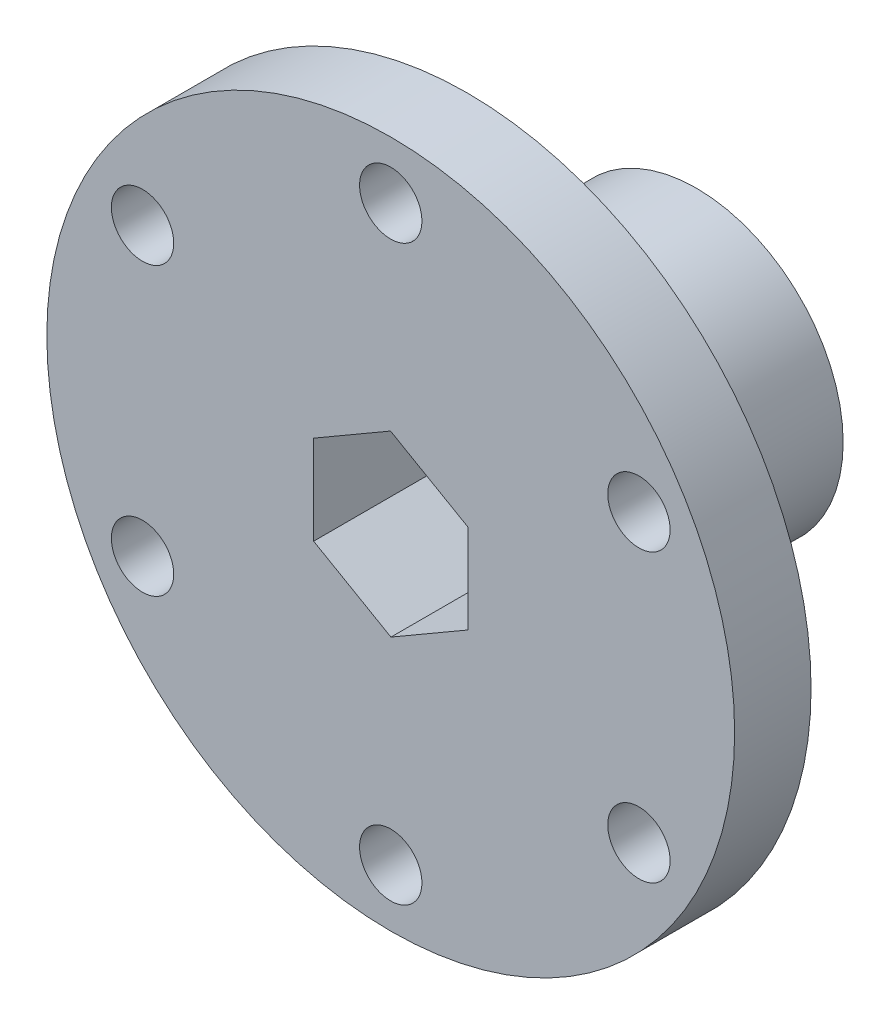
ISO-10303-21;
HEADER;
FILE_DESCRIPTION(('STEP AP214'),'2;1');
FILE_NAME('part.step','',(''),(''),'','','');
FILE_SCHEMA(('AUTOMOTIVE_DESIGN { 1 0 10303 214 1 1 1 1 }'));
ENDSEC;
DATA;
#1=APPLICATION_CONTEXT('core data for automotive mechanical design processes');
#2=APPLICATION_PROTOCOL_DEFINITION('international standard','automotive_design',2000,#1);
#3=PRODUCT_CONTEXT('',#1,'mechanical');
#4=PRODUCT('Part','Part','',(#3));
#5=PRODUCT_RELATED_PRODUCT_CATEGORY('part','',(#4));
#6=PRODUCT_DEFINITION_FORMATION('','',#4);
#7=PRODUCT_DEFINITION_CONTEXT('part definition',#1,'design');
#8=PRODUCT_DEFINITION('design','',#6,#7);
#9=PRODUCT_DEFINITION_SHAPE('','',#8);
#10=(LENGTH_UNIT() NAMED_UNIT(*) SI_UNIT(.MILLI.,.METRE.));
#11=(NAMED_UNIT(*) PLANE_ANGLE_UNIT() SI_UNIT($,.RADIAN.));
#12=(NAMED_UNIT(*) SI_UNIT($,.STERADIAN.) SOLID_ANGLE_UNIT());
#13=UNCERTAINTY_MEASURE_WITH_UNIT(LENGTH_MEASURE(1.E-05),#10,'distance_accuracy_value','');
#14=(GEOMETRIC_REPRESENTATION_CONTEXT(3) GLOBAL_UNCERTAINTY_ASSIGNED_CONTEXT((#13)) GLOBAL_UNIT_ASSIGNED_CONTEXT((#10,
#11,#12)) REPRESENTATION_CONTEXT('',''));
#15=CARTESIAN_POINT('',(0.,0.,0.));
#16=DIRECTION('',(0.,0.,1.));
#17=DIRECTION('',(1.,0.,0.));
#18=AXIS2_PLACEMENT_3D('',#15,#16,#17);
#19=CARTESIAN_POINT('',(0.,0.,6.35));
#20=DIRECTION('',(0.,0.,1.));
#21=DIRECTION('',(1.,0.,0.));
#22=AXIS2_PLACEMENT_3D('',#19,#20,#21);
#23=PLANE('',#22);
#24=DIRECTION('',(0.864943139167897,0.501869869594086,0.));
#25=VECTOR('',#24,1.);
#26=CARTESIAN_POINT('',(0.0159998569727818,-7.4056546191347,6.35));
#27=LINE('',#26,#25);
#28=CARTESIAN_POINT('',(0.0159998569727818,-7.4056546191347,6.35));
#29=VERTEX_POINT('',#28);
#30=CARTESIAN_POINT('',(6.42148496031061,-3.688971026972,6.35));
#31=VERTEX_POINT('',#30);
#32=EDGE_CURVE('E57',#29,#31,#27,.T.);
#33=ORIENTED_EDGE('',*,*,#32,.F.);
#34=DIRECTION('',(0.86710362604641,-0.498127796551414,0.));
#35=VECTOR('',#34,1.);
#36=CARTESIAN_POINT('',(-6.40548510333783,-3.7166835921627,6.35));
#37=LINE('',#36,#35);
#38=CARTESIAN_POINT('',(-6.40548510333783,-3.7166835921627,6.35));
#39=VERTEX_POINT('',#38);
#40=EDGE_CURVE('E125',#39,#29,#37,.T.);
#41=ORIENTED_EDGE('',*,*,#40,.F.);
#42=DIRECTION('',(0.00216048687851377,-0.999997666145501,0.));
#43=VECTOR('',#42,1.);
#44=CARTESIAN_POINT('',(-6.42148496031061,3.688971026972,6.35));
#45=LINE('',#44,#43);
#46=CARTESIAN_POINT('',(-6.42148496031061,3.688971026972,6.35));
#47=VERTEX_POINT('',#46);
#48=EDGE_CURVE('E131',#47,#39,#45,.T.);
#49=ORIENTED_EDGE('',*,*,#48,.F.);
#50=DIRECTION('',(-0.864943139167896,-0.501869869594086,0.));
#51=VECTOR('',#50,1.);
#52=CARTESIAN_POINT('',(-0.0159998569727818,7.4056546191347,6.35));
#53=LINE('',#52,#51);
#54=CARTESIAN_POINT('',(-0.0159998569727818,7.4056546191347,6.35));
#55=VERTEX_POINT('',#54);
#56=EDGE_CURVE('E153',#55,#47,#53,.T.);
#57=ORIENTED_EDGE('',*,*,#56,.F.);
#58=DIRECTION('',(-0.86710362604641,0.498127796551414,0.));
#59=VECTOR('',#58,1.);
#60=CARTESIAN_POINT('',(6.40548510333783,3.7166835921627,6.35));
#61=LINE('',#60,#59);
#62=CARTESIAN_POINT('',(6.40548510333783,3.7166835921627,6.35));
#63=VERTEX_POINT('',#62);
#64=EDGE_CURVE('E150',#63,#55,#61,.T.);
#65=ORIENTED_EDGE('',*,*,#64,.F.);
#66=DIRECTION('',(-0.00216048687851365,0.9999976661455,0.));
#67=VECTOR('',#66,1.);
#68=CARTESIAN_POINT('',(6.42148496031061,-3.688971026972,6.35));
#69=LINE('',#68,#67);
#70=EDGE_CURVE('E147',#31,#63,#69,.T.);
#71=ORIENTED_EDGE('',*,*,#70,.F.);
#72=EDGE_LOOP('',(#33,#41,#49,#57,#65,#71));
#73=FACE_BOUND('',#72,.T.);
#74=CARTESIAN_POINT('',(-20.6222299276159,-11.9062500000006,6.35));
#75=DIRECTION('',(0.,0.,1.));
#76=DIRECTION('',(1.,0.,0.));
#77=AXIS2_PLACEMENT_3D('',#74,#75,#76);
#78=CIRCLE('',#77,2.59080000000136);
#79=CARTESIAN_POINT('',(-18.0314299276146,-11.9062500000006,6.35));
#80=VERTEX_POINT('',#79);
#81=EDGE_CURVE('E185',#80,#80,#78,.T.);
#82=ORIENTED_EDGE('',*,*,#81,.F.);
#83=EDGE_LOOP('',(#82));
#84=FACE_BOUND('',#83,.T.);
#85=CARTESIAN_POINT('',(20.622229927618,-11.9062499999994,6.35));
#86=DIRECTION('',(0.,0.,1.));
#87=DIRECTION('',(1.,0.,0.));
#88=AXIS2_PLACEMENT_3D('',#85,#86,#87);
#89=CIRCLE('',#88,2.59080000000091);
#90=CARTESIAN_POINT('',(23.2130299276189,-11.9062499999994,6.35));
#91=VERTEX_POINT('',#90);
#92=EDGE_CURVE('E201',#91,#91,#89,.T.);
#93=ORIENTED_EDGE('',*,*,#92,.F.);
#94=EDGE_LOOP('',(#93));
#95=FACE_BOUND('',#94,.T.);
#96=CARTESIAN_POINT('',(0.,23.8125,6.35));
#97=DIRECTION('',(0.,0.,1.));
#98=DIRECTION('',(1.,0.,0.));
#99=AXIS2_PLACEMENT_3D('',#96,#97,#98);
#100=CIRCLE('',#99,2.5908);
#101=CARTESIAN_POINT('',(2.5908,23.8125,6.35));
#102=VERTEX_POINT('',#101);
#103=EDGE_CURVE('E213',#102,#102,#100,.T.);
#104=ORIENTED_EDGE('',*,*,#103,.F.);
#105=EDGE_LOOP('',(#104));
#106=FACE_BOUND('',#105,.T.);
#107=CARTESIAN_POINT('',(0.,0.,6.35));
#108=DIRECTION('',(0.,0.,1.));
#109=DIRECTION('',(1.,0.,0.));
#110=AXIS2_PLACEMENT_3D('',#107,#108,#109);
#111=CIRCLE('',#110,28.575);
#112=CARTESIAN_POINT('',(28.575,0.,6.35));
#113=VERTEX_POINT('',#112);
#114=EDGE_CURVE('E47',#113,#113,#111,.T.);
#115=ORIENTED_EDGE('',*,*,#114,.T.);
#116=EDGE_LOOP('',(#115));
#117=FACE_BOUND('',#116,.T.);
#118=CARTESIAN_POINT('',(20.6222299276173,11.9062500000006,6.35));
#119=DIRECTION('',(0.,0.,1.));
#120=DIRECTION('',(1.,0.,0.));
#121=AXIS2_PLACEMENT_3D('',#118,#119,#120);
#122=CIRCLE('',#121,2.59080000000021);
#123=CARTESIAN_POINT('',(23.2130299276175,11.9062500000006,6.35));
#124=VERTEX_POINT('',#123);
#125=EDGE_CURVE('E207',#124,#124,#122,.T.);
#126=ORIENTED_EDGE('',*,*,#125,.F.);
#127=EDGE_LOOP('',(#126));
#128=FACE_BOUND('',#127,.T.);
#129=CARTESIAN_POINT('',(1.34775153124205E-12,-23.8125,6.35));
#130=DIRECTION('',(0.,0.,1.));
#131=DIRECTION('',(1.,0.,0.));
#132=AXIS2_PLACEMENT_3D('',#129,#130,#131);
#133=CIRCLE('',#132,2.59080000000145);
#134=CARTESIAN_POINT('',(2.5908000000028,-23.8125,6.35));
#135=VERTEX_POINT('',#134);
#136=EDGE_CURVE('E193',#135,#135,#133,.T.);
#137=ORIENTED_EDGE('',*,*,#136,.F.);
#138=EDGE_LOOP('',(#137));
#139=FACE_BOUND('',#138,.T.);
#140=CARTESIAN_POINT('',(-20.6222299276166,11.9062499999994,6.35));
#141=DIRECTION('',(0.,0.,1.));
#142=DIRECTION('',(1.,0.,0.));
#143=AXIS2_PLACEMENT_3D('',#140,#141,#142);
#144=CIRCLE('',#143,2.59080000000078);
#145=CARTESIAN_POINT('',(-18.0314299276158,11.9062499999994,6.35));
#146=VERTEX_POINT('',#145);
#147=EDGE_CURVE('E178',#146,#146,#144,.T.);
#148=ORIENTED_EDGE('',*,*,#147,.F.);
#149=EDGE_LOOP('',(#148));
#150=FACE_BOUND('',#149,.T.);
#151=ADVANCED_FACE('F38',(#73,#84,#95,#106,#117,#128,#139,#150),#23,.T.);
#152=CARTESIAN_POINT('',(0.,0.,0.));
#153=DIRECTION('',(0.,0.,1.));
#154=DIRECTION('',(1.,0.,0.));
#155=AXIS2_PLACEMENT_3D('',#152,#153,#154);
#156=PLANE('',#155);
#157=CARTESIAN_POINT('',(0.,0.,0.));
#158=DIRECTION('',(0.,0.,1.));
#159=DIRECTION('',(1.,0.,0.));
#160=AXIS2_PLACEMENT_3D('',#157,#158,#159);
#161=CIRCLE('',#160,12.192);
#162=CARTESIAN_POINT('',(12.192,0.,0.));
#163=VERTEX_POINT('',#162);
#164=EDGE_CURVE('E11',#163,#163,#161,.F.);
#165=ORIENTED_EDGE('',*,*,#164,.F.);
#166=EDGE_LOOP('',(#165));
#167=FACE_BOUND('',#166,.T.);
#168=CARTESIAN_POINT('',(0.,0.,0.));
#169=DIRECTION('',(0.,0.,1.));
#170=DIRECTION('',(1.,0.,0.));
#171=AXIS2_PLACEMENT_3D('',#168,#169,#170);
#172=CIRCLE('',#171,28.575);
#173=CARTESIAN_POINT('',(28.575,0.,0.));
#174=VERTEX_POINT('',#173);
#175=EDGE_CURVE('E217',#174,#174,#172,.T.);
#176=ORIENTED_EDGE('',*,*,#175,.F.);
#177=EDGE_LOOP('',(#176));
#178=FACE_BOUND('',#177,.T.);
#179=CARTESIAN_POINT('',(0.,23.8125,0.));
#180=DIRECTION('',(0.,0.,1.));
#181=DIRECTION('',(1.,0.,0.));
#182=AXIS2_PLACEMENT_3D('',#179,#180,#181);
#183=CIRCLE('',#182,2.5908);
#184=CARTESIAN_POINT('',(2.5908,23.8125,0.));
#185=VERTEX_POINT('',#184);
#186=EDGE_CURVE('E210',#185,#185,#183,.T.);
#187=ORIENTED_EDGE('',*,*,#186,.T.);
#188=EDGE_LOOP('',(#187));
#189=FACE_BOUND('',#188,.T.);
#190=CARTESIAN_POINT('',(20.6222299276173,11.9062500000006,0.));
#191=DIRECTION('',(0.,0.,1.));
#192=DIRECTION('',(1.,0.,0.));
#193=AXIS2_PLACEMENT_3D('',#190,#191,#192);
#194=CIRCLE('',#193,2.59080000000021);
#195=CARTESIAN_POINT('',(23.2130299276175,11.9062500000006,0.));
#196=VERTEX_POINT('',#195);
#197=EDGE_CURVE('E204',#196,#196,#194,.T.);
#198=ORIENTED_EDGE('',*,*,#197,.T.);
#199=EDGE_LOOP('',(#198));
#200=FACE_BOUND('',#199,.T.);
#201=CARTESIAN_POINT('',(20.622229927618,-11.9062499999994,0.));
#202=DIRECTION('',(0.,0.,1.));
#203=DIRECTION('',(1.,0.,0.));
#204=AXIS2_PLACEMENT_3D('',#201,#202,#203);
#205=CIRCLE('',#204,2.59080000000091);
#206=CARTESIAN_POINT('',(23.2130299276189,-11.9062499999994,0.));
#207=VERTEX_POINT('',#206);
#208=EDGE_CURVE('E197',#207,#207,#205,.T.);
#209=ORIENTED_EDGE('',*,*,#208,.T.);
#210=EDGE_LOOP('',(#209));
#211=FACE_BOUND('',#210,.T.);
#212=CARTESIAN_POINT('',(1.34775153124205E-12,-23.8125,0.));
#213=DIRECTION('',(0.,0.,1.));
#214=DIRECTION('',(1.,0.,0.));
#215=AXIS2_PLACEMENT_3D('',#212,#213,#214);
#216=CIRCLE('',#215,2.59080000000145);
#217=CARTESIAN_POINT('',(2.5908000000028,-23.8125,0.));
#218=VERTEX_POINT('',#217);
#219=EDGE_CURVE('E189',#218,#218,#216,.T.);
#220=ORIENTED_EDGE('',*,*,#219,.T.);
#221=EDGE_LOOP('',(#220));
#222=FACE_BOUND('',#221,.T.);
#223=CARTESIAN_POINT('',(-20.6222299276159,-11.9062500000006,0.));
#224=DIRECTION('',(0.,0.,1.));
#225=DIRECTION('',(1.,0.,0.));
#226=AXIS2_PLACEMENT_3D('',#223,#224,#225);
#227=CIRCLE('',#226,2.59080000000136);
#228=CARTESIAN_POINT('',(-18.0314299276146,-11.9062500000006,0.));
#229=VERTEX_POINT('',#228);
#230=EDGE_CURVE('E181',#229,#229,#227,.T.);
#231=ORIENTED_EDGE('',*,*,#230,.T.);
#232=EDGE_LOOP('',(#231));
#233=FACE_BOUND('',#232,.T.);
#234=CARTESIAN_POINT('',(-20.6222299276166,11.9062499999994,0.));
#235=DIRECTION('',(0.,0.,1.));
#236=DIRECTION('',(1.,0.,0.));
#237=AXIS2_PLACEMENT_3D('',#234,#235,#236);
#238=CIRCLE('',#237,2.59080000000078);
#239=CARTESIAN_POINT('',(-18.0314299276158,11.9062499999994,0.));
#240=VERTEX_POINT('',#239);
#241=EDGE_CURVE('E177',#240,#240,#238,.T.);
#242=ORIENTED_EDGE('',*,*,#241,.T.);
#243=EDGE_LOOP('',(#242));
#244=FACE_BOUND('',#243,.T.);
#245=ADVANCED_FACE('F228',(#167,#178,#189,#200,#211,#222,#233,#244),#156,.F.);
#246=CARTESIAN_POINT('',(0.,0.,6.35));
#247=DIRECTION('',(0.,0.,-1.));
#248=DIRECTION('',(-1.,0.,0.));
#249=AXIS2_PLACEMENT_3D('',#246,#247,#248);
#250=CYLINDRICAL_SURFACE('',#249,28.575);
#251=ORIENTED_EDGE('',*,*,#114,.F.);
#252=EDGE_LOOP('',(#251));
#253=FACE_BOUND('',#252,.T.);
#254=ORIENTED_EDGE('',*,*,#175,.T.);
#255=EDGE_LOOP('',(#254));
#256=FACE_BOUND('',#255,.T.);
#257=ADVANCED_FACE('F40',(#253,#256),#250,.T.);
#258=CARTESIAN_POINT('',(0.,23.8125,6.35));
#259=DIRECTION('',(0.,0.,-1.));
#260=DIRECTION('',(-1.,0.,0.));
#261=AXIS2_PLACEMENT_3D('',#258,#259,#260);
#262=CYLINDRICAL_SURFACE('',#261,2.5908);
#263=ORIENTED_EDGE('',*,*,#103,.T.);
#264=EDGE_LOOP('',(#263));
#265=FACE_BOUND('',#264,.T.);
#266=ORIENTED_EDGE('',*,*,#186,.F.);
#267=EDGE_LOOP('',(#266));
#268=FACE_BOUND('',#267,.T.);
#269=ADVANCED_FACE('F266',(#265,#268),#262,.F.);
#270=CARTESIAN_POINT('',(20.6222299276173,11.9062500000006,6.35));
#271=DIRECTION('',(0.,0.,-1.));
#272=DIRECTION('',(-1.,0.,0.));
#273=AXIS2_PLACEMENT_3D('',#270,#271,#272);
#274=CYLINDRICAL_SURFACE('',#273,2.59080000000021);
#275=ORIENTED_EDGE('',*,*,#125,.T.);
#276=EDGE_LOOP('',(#275));
#277=FACE_BOUND('',#276,.T.);
#278=ORIENTED_EDGE('',*,*,#197,.F.);
#279=EDGE_LOOP('',(#278));
#280=FACE_BOUND('',#279,.T.);
#281=ADVANCED_FACE('F269',(#277,#280),#274,.F.);
#282=CARTESIAN_POINT('',(20.622229927618,-11.9062499999994,6.35));
#283=DIRECTION('',(0.,0.,-1.));
#284=DIRECTION('',(-1.,0.,0.));
#285=AXIS2_PLACEMENT_3D('',#282,#283,#284);
#286=CYLINDRICAL_SURFACE('',#285,2.59080000000091);
#287=ORIENTED_EDGE('',*,*,#92,.T.);
#288=EDGE_LOOP('',(#287));
#289=FACE_BOUND('',#288,.T.);
#290=ORIENTED_EDGE('',*,*,#208,.F.);
#291=EDGE_LOOP('',(#290));
#292=FACE_BOUND('',#291,.T.);
#293=ADVANCED_FACE('F273',(#289,#292),#286,.F.);
#294=CARTESIAN_POINT('',(1.34775153124205E-12,-23.8125,6.35));
#295=DIRECTION('',(0.,0.,-1.));
#296=DIRECTION('',(-1.,0.,0.));
#297=AXIS2_PLACEMENT_3D('',#294,#295,#296);
#298=CYLINDRICAL_SURFACE('',#297,2.59080000000145);
#299=ORIENTED_EDGE('',*,*,#136,.T.);
#300=EDGE_LOOP('',(#299));
#301=FACE_BOUND('',#300,.T.);
#302=ORIENTED_EDGE('',*,*,#219,.F.);
#303=EDGE_LOOP('',(#302));
#304=FACE_BOUND('',#303,.T.);
#305=ADVANCED_FACE('F256',(#301,#304),#298,.F.);
#306=CARTESIAN_POINT('',(-20.6222299276159,-11.9062500000006,6.35));
#307=DIRECTION('',(0.,0.,-1.));
#308=DIRECTION('',(-1.,0.,0.));
#309=AXIS2_PLACEMENT_3D('',#306,#307,#308);
#310=CYLINDRICAL_SURFACE('',#309,2.59080000000136);
#311=ORIENTED_EDGE('',*,*,#81,.T.);
#312=EDGE_LOOP('',(#311));
#313=FACE_BOUND('',#312,.T.);
#314=ORIENTED_EDGE('',*,*,#230,.F.);
#315=EDGE_LOOP('',(#314));
#316=FACE_BOUND('',#315,.T.);
#317=ADVANCED_FACE('F247',(#313,#316),#310,.F.);
#318=CARTESIAN_POINT('',(-20.6222299276166,11.9062499999994,6.35));
#319=DIRECTION('',(0.,0.,-1.));
#320=DIRECTION('',(-1.,0.,0.));
#321=AXIS2_PLACEMENT_3D('',#318,#319,#320);
#322=CYLINDRICAL_SURFACE('',#321,2.59080000000078);
#323=ORIENTED_EDGE('',*,*,#147,.T.);
#324=EDGE_LOOP('',(#323));
#325=FACE_BOUND('',#324,.T.);
#326=ORIENTED_EDGE('',*,*,#241,.F.);
#327=EDGE_LOOP('',(#326));
#328=FACE_BOUND('',#327,.T.);
#329=ADVANCED_FACE('F244',(#325,#328),#322,.F.);
#330=CARTESIAN_POINT('',(0.,0.,-19.05));
#331=DIRECTION('',(0.,0.,1.));
#332=DIRECTION('',(1.,0.,0.));
#333=AXIS2_PLACEMENT_3D('',#330,#331,#332);
#334=CYLINDRICAL_SURFACE('',#333,12.192);
#335=CARTESIAN_POINT('',(0.,0.,-19.05));
#336=DIRECTION('',(0.,0.,-1.));
#337=DIRECTION('',(-1.,0.,0.));
#338=AXIS2_PLACEMENT_3D('',#335,#336,#337);
#339=CIRCLE('',#338,12.192);
#340=CARTESIAN_POINT('',(-12.192,0.,-19.05));
#341=VERTEX_POINT('',#340);
#342=EDGE_CURVE('E162',#341,#341,#339,.T.);
#343=ORIENTED_EDGE('',*,*,#342,.F.);
#344=EDGE_LOOP('',(#343));
#345=FACE_BOUND('',#344,.T.);
#346=ORIENTED_EDGE('',*,*,#164,.T.);
#347=EDGE_LOOP('',(#346));
#348=FACE_BOUND('',#347,.T.);
#349=ADVANCED_FACE('F246',(#345,#348),#334,.T.);
#350=CARTESIAN_POINT('',(0.,0.,-19.05));
#351=DIRECTION('',(0.,0.,-1.));
#352=DIRECTION('',(-1.,0.,0.));
#353=AXIS2_PLACEMENT_3D('',#350,#351,#352);
#354=PLANE('',#353);
#355=DIRECTION('',(0.864943139167897,0.501869869594086,0.));
#356=VECTOR('',#355,1.);
#357=CARTESIAN_POINT('',(0.0159998569727818,-7.4056546191347,-19.05));
#358=LINE('',#357,#356);
#359=CARTESIAN_POINT('',(0.0159998569727818,-7.4056546191347,-19.05));
#360=VERTEX_POINT('',#359);
#361=CARTESIAN_POINT('',(6.42148496031061,-3.688971026972,-19.05));
#362=VERTEX_POINT('',#361);
#363=EDGE_CURVE('E105',#360,#362,#358,.T.);
#364=ORIENTED_EDGE('',*,*,#363,.T.);
#365=DIRECTION('',(-0.00216048687851365,0.9999976661455,0.));
#366=VECTOR('',#365,1.);
#367=CARTESIAN_POINT('',(6.42148496031061,-3.688971026972,-19.05));
#368=LINE('',#367,#366);
#369=CARTESIAN_POINT('',(6.40548510333783,3.7166835921627,-19.05));
#370=VERTEX_POINT('',#369);
#371=EDGE_CURVE('E115',#362,#370,#368,.T.);
#372=ORIENTED_EDGE('',*,*,#371,.T.);
#373=DIRECTION('',(-0.86710362604641,0.498127796551414,0.));
#374=VECTOR('',#373,1.);
#375=CARTESIAN_POINT('',(6.40548510333783,3.7166835921627,-19.05));
#376=LINE('',#375,#374);
#377=CARTESIAN_POINT('',(-0.0159998569727818,7.4056546191347,-19.05));
#378=VERTEX_POINT('',#377);
#379=EDGE_CURVE('E67',#370,#378,#376,.T.);
#380=ORIENTED_EDGE('',*,*,#379,.T.);
#381=DIRECTION('',(-0.864943139167896,-0.501869869594086,0.));
#382=VECTOR('',#381,1.);
#383=CARTESIAN_POINT('',(-0.0159998569727818,7.4056546191347,-19.05));
#384=LINE('',#383,#382);
#385=CARTESIAN_POINT('',(-6.42148496031061,3.688971026972,-19.05));
#386=VERTEX_POINT('',#385);
#387=EDGE_CURVE('E136',#378,#386,#384,.T.);
#388=ORIENTED_EDGE('',*,*,#387,.T.);
#389=DIRECTION('',(0.00216048687851377,-0.999997666145501,0.));
#390=VECTOR('',#389,1.);
#391=CARTESIAN_POINT('',(-6.42148496031061,3.688971026972,-19.05));
#392=LINE('',#391,#390);
#393=CARTESIAN_POINT('',(-6.40548510333783,-3.7166835921627,-19.05));
#394=VERTEX_POINT('',#393);
#395=EDGE_CURVE('E140',#386,#394,#392,.T.);
#396=ORIENTED_EDGE('',*,*,#395,.T.);
#397=DIRECTION('',(0.86710362604641,-0.498127796551414,0.));
#398=VECTOR('',#397,1.);
#399=CARTESIAN_POINT('',(-6.40548510333783,-3.7166835921627,-19.05));
#400=LINE('',#399,#398);
#401=EDGE_CURVE('E112',#394,#360,#400,.T.);
#402=ORIENTED_EDGE('',*,*,#401,.T.);
#403=EDGE_LOOP('',(#364,#372,#380,#388,#396,#402));
#404=FACE_BOUND('',#403,.T.);
#405=ORIENTED_EDGE('',*,*,#342,.T.);
#406=EDGE_LOOP('',(#405));
#407=FACE_BOUND('',#406,.T.);
#408=ADVANCED_FACE('F120',(#404,#407),#354,.T.);
#409=CARTESIAN_POINT('',(0.0159998569727818,-7.4056546191347,-19.05));
#410=DIRECTION('',(0.501869869594086,-0.864943139167896,0.));
#411=DIRECTION('',(0.864943139167896,0.501869869594086,0.));
#412=AXIS2_PLACEMENT_3D('',#409,#410,#411);
#413=PLANE('',#412);
#414=ORIENTED_EDGE('',*,*,#32,.T.);
#415=DIRECTION('',(0.,0.,1.));
#416=VECTOR('',#415,1.);
#417=CARTESIAN_POINT('',(6.42148496031061,-3.688971026972,-19.05));
#418=LINE('',#417,#416);
#419=EDGE_CURVE('E101',#362,#31,#418,.T.);
#420=ORIENTED_EDGE('',*,*,#419,.F.);
#421=ORIENTED_EDGE('',*,*,#363,.F.);
#422=DIRECTION('',(0.,0.,1.));
#423=VECTOR('',#422,1.);
#424=CARTESIAN_POINT('',(0.0159998569727818,-7.4056546191347,-19.05));
#425=LINE('',#424,#423);
#426=EDGE_CURVE('E160',#360,#29,#425,.T.);
#427=ORIENTED_EDGE('',*,*,#426,.T.);
#428=EDGE_LOOP('',(#414,#420,#421,#427));
#429=FACE_BOUND('',#428,.T.);
#430=ADVANCED_FACE('F103',(#429),#413,.F.);
#431=CARTESIAN_POINT('',(-6.40548510333783,-3.7166835921627,-19.05));
#432=DIRECTION('',(-0.498127796551414,-0.86710362604641,0.));
#433=DIRECTION('',(0.86710362604641,-0.498127796551415,0.));
#434=AXIS2_PLACEMENT_3D('',#431,#432,#433);
#435=PLANE('',#434);
#436=ORIENTED_EDGE('',*,*,#40,.T.);
#437=ORIENTED_EDGE('',*,*,#426,.F.);
#438=ORIENTED_EDGE('',*,*,#401,.F.);
#439=DIRECTION('',(0.,0.,1.));
#440=VECTOR('',#439,1.);
#441=CARTESIAN_POINT('',(-6.40548510333783,-3.7166835921627,-19.05));
#442=LINE('',#441,#440);
#443=EDGE_CURVE('E163',#394,#39,#442,.T.);
#444=ORIENTED_EDGE('',*,*,#443,.T.);
#445=EDGE_LOOP('',(#436,#437,#438,#444));
#446=FACE_BOUND('',#445,.T.);
#447=ADVANCED_FACE('F342',(#446),#435,.F.);
#448=CARTESIAN_POINT('',(-6.42148496031061,3.688971026972,-19.05));
#449=DIRECTION('',(-0.9999976661455,-0.00216048687851377,0.));
#450=DIRECTION('',(0.00216048687851377,-0.999997666145501,0.));
#451=AXIS2_PLACEMENT_3D('',#448,#449,#450);
#452=PLANE('',#451);
#453=ORIENTED_EDGE('',*,*,#48,.T.);
#454=ORIENTED_EDGE('',*,*,#443,.F.);
#455=ORIENTED_EDGE('',*,*,#395,.F.);
#456=DIRECTION('',(0.,0.,1.));
#457=VECTOR('',#456,1.);
#458=CARTESIAN_POINT('',(-6.42148496031061,3.688971026972,-19.05));
#459=LINE('',#458,#457);
#460=EDGE_CURVE('E166',#386,#47,#459,.T.);
#461=ORIENTED_EDGE('',*,*,#460,.T.);
#462=EDGE_LOOP('',(#453,#454,#455,#461));
#463=FACE_BOUND('',#462,.T.);
#464=ADVANCED_FACE('F334',(#463),#452,.F.);
#465=CARTESIAN_POINT('',(-0.0159998569727818,7.4056546191347,-19.05));
#466=DIRECTION('',(-0.501869869594086,0.864943139167896,0.));
#467=DIRECTION('',(-0.864943139167896,-0.501869869594086,0.));
#468=AXIS2_PLACEMENT_3D('',#465,#466,#467);
#469=PLANE('',#468);
#470=ORIENTED_EDGE('',*,*,#56,.T.);
#471=ORIENTED_EDGE('',*,*,#460,.F.);
#472=ORIENTED_EDGE('',*,*,#387,.F.);
#473=DIRECTION('',(0.,0.,1.));
#474=VECTOR('',#473,1.);
#475=CARTESIAN_POINT('',(-0.0159998569727818,7.4056546191347,-19.05));
#476=LINE('',#475,#474);
#477=EDGE_CURVE('E169',#378,#55,#476,.T.);
#478=ORIENTED_EDGE('',*,*,#477,.T.);
#479=EDGE_LOOP('',(#470,#471,#472,#478));
#480=FACE_BOUND('',#479,.T.);
#481=ADVANCED_FACE('F311',(#480),#469,.F.);
#482=CARTESIAN_POINT('',(6.40548510333783,3.7166835921627,-19.05));
#483=DIRECTION('',(0.498127796551414,0.86710362604641,0.));
#484=DIRECTION('',(-0.86710362604641,0.498127796551415,0.));
#485=AXIS2_PLACEMENT_3D('',#482,#483,#484);
#486=PLANE('',#485);
#487=ORIENTED_EDGE('',*,*,#64,.T.);
#488=ORIENTED_EDGE('',*,*,#477,.F.);
#489=ORIENTED_EDGE('',*,*,#379,.F.);
#490=DIRECTION('',(0.,0.,1.));
#491=VECTOR('',#490,1.);
#492=CARTESIAN_POINT('',(6.40548510333783,3.7166835921627,-19.05));
#493=LINE('',#492,#491);
#494=EDGE_CURVE('E111',#370,#63,#493,.T.);
#495=ORIENTED_EDGE('',*,*,#494,.T.);
#496=EDGE_LOOP('',(#487,#488,#489,#495));
#497=FACE_BOUND('',#496,.T.);
#498=ADVANCED_FACE('F308',(#497),#486,.F.);
#499=CARTESIAN_POINT('',(6.42148496031061,-3.688971026972,-19.05));
#500=DIRECTION('',(0.9999976661455,0.00216048687851365,0.));
#501=DIRECTION('',(-0.00216048687851365,0.999997666145501,0.));
#502=AXIS2_PLACEMENT_3D('',#499,#500,#501);
#503=PLANE('',#502);
#504=ORIENTED_EDGE('',*,*,#70,.T.);
#505=ORIENTED_EDGE('',*,*,#494,.F.);
#506=ORIENTED_EDGE('',*,*,#371,.F.);
#507=ORIENTED_EDGE('',*,*,#419,.T.);
#508=EDGE_LOOP('',(#504,#505,#506,#507));
#509=FACE_BOUND('',#508,.T.);
#510=ADVANCED_FACE('F116',(#509),#503,.F.);
#511=CLOSED_SHELL('',(#151,#245,#257,#269,#281,#293,#305,#317,#329,#349,#408,#430,#447,#464,
#481,#498,#510));
#512=MANIFOLD_SOLID_BREP('B2',#511);
#513=ADVANCED_BREP_SHAPE_REPRESENTATION('',(#18,#512),#14);
#514=SHAPE_DEFINITION_REPRESENTATION(#9,#513);
ENDSEC;
END-ISO-10303-21;
